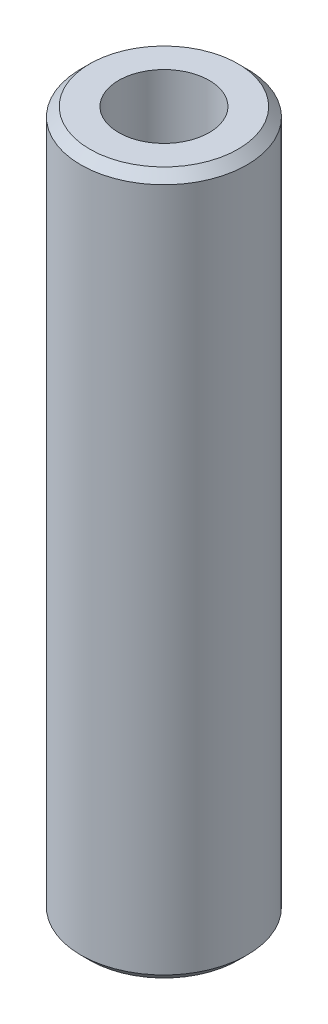
ISO-10303-21;
HEADER;
FILE_DESCRIPTION(('STEP AP214'),'2;1');
FILE_NAME('part.step','',(''),(''),'','','');
FILE_SCHEMA(('AUTOMOTIVE_DESIGN { 1 0 10303 214 1 1 1 1 }'));
ENDSEC;
DATA;
#1=APPLICATION_CONTEXT('core data for automotive mechanical design processes');
#2=APPLICATION_PROTOCOL_DEFINITION('international standard','automotive_design',2000,#1);
#3=PRODUCT_CONTEXT('',#1,'mechanical');
#4=PRODUCT('Part','Part','',(#3));
#5=PRODUCT_RELATED_PRODUCT_CATEGORY('part','',(#4));
#6=PRODUCT_DEFINITION_FORMATION('','',#4);
#7=PRODUCT_DEFINITION_CONTEXT('part definition',#1,'design');
#8=PRODUCT_DEFINITION('design','',#6,#7);
#9=PRODUCT_DEFINITION_SHAPE('','',#8);
#10=(LENGTH_UNIT() NAMED_UNIT(*) SI_UNIT(.MILLI.,.METRE.));
#11=(NAMED_UNIT(*) PLANE_ANGLE_UNIT() SI_UNIT($,.RADIAN.));
#12=(NAMED_UNIT(*) SI_UNIT($,.STERADIAN.) SOLID_ANGLE_UNIT());
#13=UNCERTAINTY_MEASURE_WITH_UNIT(LENGTH_MEASURE(1.E-05),#10,'distance_accuracy_value','');
#14=(GEOMETRIC_REPRESENTATION_CONTEXT(3) GLOBAL_UNCERTAINTY_ASSIGNED_CONTEXT((#13)) GLOBAL_UNIT_ASSIGNED_CONTEXT((#10,
#11,#12)) REPRESENTATION_CONTEXT('',''));
#15=CARTESIAN_POINT('',(0.,0.,0.));
#16=DIRECTION('',(0.,0.,1.));
#17=DIRECTION('',(1.,0.,0.));
#18=AXIS2_PLACEMENT_3D('',#15,#16,#17);
#19=CARTESIAN_POINT('',(0.,464.77778374933,0.));
#20=DIRECTION('',(0.,-1.,0.));
#21=DIRECTION('',(0.,0.,-1.));
#22=AXIS2_PLACEMENT_3D('',#19,#20,#21);
#23=CYLINDRICAL_SURFACE('',#22,55.);
#24=CARTESIAN_POINT('',(0.,458.795499994721,0.));
#25=DIRECTION('',(0.,1.,0.));
#26=DIRECTION('',(0.,0.,1.));
#27=AXIS2_PLACEMENT_3D('',#24,#25,#26);
#28=CIRCLE('',#27,55.);
#29=CARTESIAN_POINT('',(0.,458.795499994721,55.));
#30=VERTEX_POINT('',#29);
#31=EDGE_CURVE('E50',#30,#30,#28,.F.);
#32=ORIENTED_EDGE('',*,*,#31,.T.);
#33=EDGE_LOOP('',(#32));
#34=FACE_BOUND('',#33,.T.);
#35=CARTESIAN_POINT('',(0.,5.98228375460869,0.));
#36=DIRECTION('',(0.,1.,0.));
#37=DIRECTION('',(0.,0.,1.));
#38=AXIS2_PLACEMENT_3D('',#35,#36,#37);
#39=CIRCLE('',#38,55.);
#40=CARTESIAN_POINT('',(0.,5.98228375460869,55.));
#41=VERTEX_POINT('',#40);
#42=EDGE_CURVE('E51',#41,#41,#39,.T.);
#43=ORIENTED_EDGE('',*,*,#42,.T.);
#44=EDGE_LOOP('',(#43));
#45=FACE_BOUND('',#44,.T.);
#46=ADVANCED_FACE('F39',(#34,#45),#23,.T.);
#47=CARTESIAN_POINT('',(0.,464.77778374933,0.));
#48=DIRECTION('',(0.,1.,0.));
#49=DIRECTION('',(0.,0.,1.));
#50=AXIS2_PLACEMENT_3D('',#47,#48,#49);
#51=PLANE('',#50);
#52=CARTESIAN_POINT('',(0.,464.77778374933,0.));
#53=DIRECTION('',(0.,1.,0.));
#54=DIRECTION('',(0.,0.,1.));
#55=AXIS2_PLACEMENT_3D('',#52,#53,#54);
#56=CIRCLE('',#55,49.0177162453911);
#57=CARTESIAN_POINT('',(0.,464.77778374933,49.0177162453911));
#58=VERTEX_POINT('',#57);
#59=EDGE_CURVE('E54',#58,#58,#56,.T.);
#60=ORIENTED_EDGE('',*,*,#59,.T.);
#61=EDGE_LOOP('',(#60));
#62=FACE_BOUND('',#61,.T.);
#63=CARTESIAN_POINT('',(0.,464.77778374933,0.));
#64=DIRECTION('',(0.,1.,0.));
#65=DIRECTION('',(0.,0.,1.));
#66=AXIS2_PLACEMENT_3D('',#63,#64,#65);
#67=CIRCLE('',#66,29.9628950605625);
#68=CARTESIAN_POINT('',(0.,464.77778374933,29.9628950605625));
#69=VERTEX_POINT('',#68);
#70=EDGE_CURVE('E58',#69,#69,#67,.T.);
#71=ORIENTED_EDGE('',*,*,#70,.F.);
#72=EDGE_LOOP('',(#71));
#73=FACE_BOUND('',#72,.T.);
#74=ADVANCED_FACE('F69',(#62,#73),#51,.T.);
#75=CARTESIAN_POINT('',(0.,0.,0.));
#76=DIRECTION('',(0.,1.,0.));
#77=DIRECTION('',(0.,0.,1.));
#78=AXIS2_PLACEMENT_3D('',#75,#76,#77);
#79=PLANE('',#78);
#80=CARTESIAN_POINT('',(0.,0.,0.));
#81=DIRECTION('',(0.,1.,0.));
#82=DIRECTION('',(0.,0.,1.));
#83=AXIS2_PLACEMENT_3D('',#80,#81,#82);
#84=CIRCLE('',#83,49.0177162453912);
#85=CARTESIAN_POINT('',(0.,0.,49.0177162453912));
#86=VERTEX_POINT('',#85);
#87=EDGE_CURVE('E10',#86,#86,#84,.F.);
#88=ORIENTED_EDGE('',*,*,#87,.T.);
#89=EDGE_LOOP('',(#88));
#90=FACE_BOUND('',#89,.T.);
#91=CARTESIAN_POINT('',(0.,0.,0.));
#92=DIRECTION('',(0.,1.,0.));
#93=DIRECTION('',(0.,0.,1.));
#94=AXIS2_PLACEMENT_3D('',#91,#92,#93);
#95=CIRCLE('',#94,29.9628950605625);
#96=CARTESIAN_POINT('',(0.,0.,29.9628950605625));
#97=VERTEX_POINT('',#96);
#98=EDGE_CURVE('E63',#97,#97,#95,.T.);
#99=ORIENTED_EDGE('',*,*,#98,.T.);
#100=EDGE_LOOP('',(#99));
#101=FACE_BOUND('',#100,.T.);
#102=ADVANCED_FACE('F75',(#90,#101),#79,.F.);
#103=CARTESIAN_POINT('',(0.,464.77778374933,0.));
#104=DIRECTION('',(0.,-1.,0.));
#105=DIRECTION('',(0.,0.,-1.));
#106=AXIS2_PLACEMENT_3D('',#103,#104,#105);
#107=CYLINDRICAL_SURFACE('',#106,29.9628950605625);
#108=ORIENTED_EDGE('',*,*,#70,.T.);
#109=EDGE_LOOP('',(#108));
#110=FACE_BOUND('',#109,.T.);
#111=ORIENTED_EDGE('',*,*,#98,.F.);
#112=EDGE_LOOP('',(#111));
#113=FACE_BOUND('',#112,.T.);
#114=ADVANCED_FACE('F70',(#110,#113),#107,.F.);
#115=CARTESIAN_POINT('',(0.,464.77778374933,0.));
#116=DIRECTION('',(0.,-1.,0.));
#117=DIRECTION('',(0.,0.,-1.));
#118=AXIS2_PLACEMENT_3D('',#115,#116,#117);
#119=CONICAL_SURFACE('',#118,49.0177162453911,0.785398163397444);
#120=ORIENTED_EDGE('',*,*,#31,.F.);
#121=EDGE_LOOP('',(#120));
#122=FACE_BOUND('',#121,.T.);
#123=ORIENTED_EDGE('',*,*,#59,.F.);
#124=EDGE_LOOP('',(#123));
#125=FACE_BOUND('',#124,.T.);
#126=ADVANCED_FACE('F81',(#122,#125),#119,.T.);
#127=CARTESIAN_POINT('',(0.,5.98228375460869,0.));
#128=DIRECTION('',(0.,1.,0.));
#129=DIRECTION('',(0.,0.,1.));
#130=AXIS2_PLACEMENT_3D('',#127,#128,#129);
#131=CONICAL_SURFACE('',#130,55.,0.785398163397453);
#132=ORIENTED_EDGE('',*,*,#87,.F.);
#133=EDGE_LOOP('',(#132));
#134=FACE_BOUND('',#133,.T.);
#135=ORIENTED_EDGE('',*,*,#42,.F.);
#136=EDGE_LOOP('',(#135));
#137=FACE_BOUND('',#136,.T.);
#138=ADVANCED_FACE('F45',(#134,#137),#131,.T.);
#139=CLOSED_SHELL('',(#46,#74,#102,#114,#126,#138));
#140=MANIFOLD_SOLID_BREP('B2',#139);
#141=ADVANCED_BREP_SHAPE_REPRESENTATION('',(#18,#140),#14);
#142=SHAPE_DEFINITION_REPRESENTATION(#9,#141);
ENDSEC;
END-ISO-10303-21;
